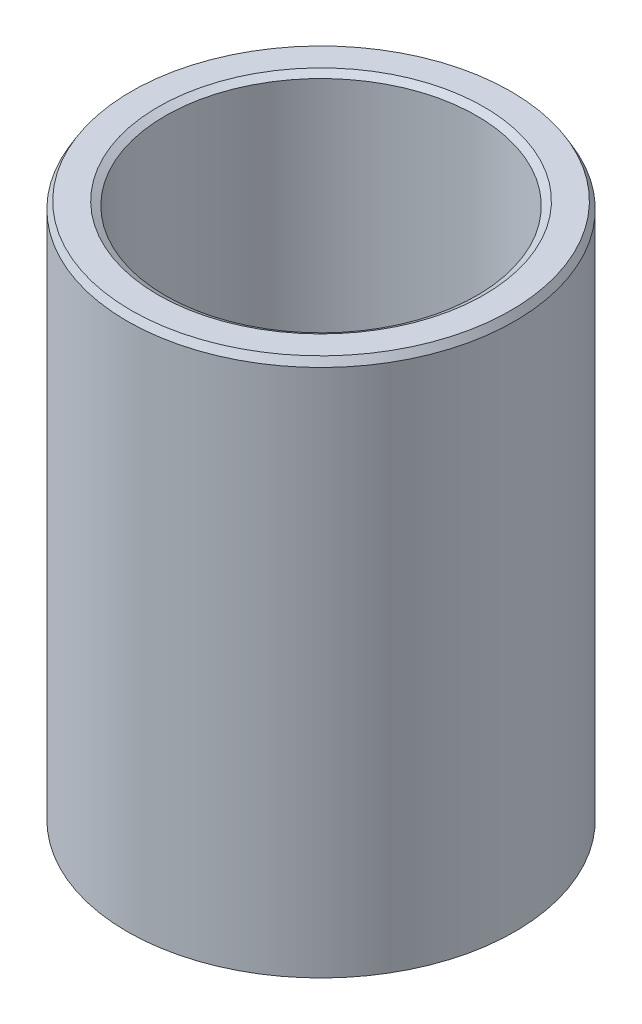
ISO-10303-21;
HEADER;
FILE_DESCRIPTION(('STEP AP214'),'2;1');
FILE_NAME('part.step','',(''),(''),'','','');
FILE_SCHEMA(('AUTOMOTIVE_DESIGN { 1 0 10303 214 1 1 1 1 }'));
ENDSEC;
DATA;
#1=APPLICATION_CONTEXT('core data for automotive mechanical design processes');
#2=APPLICATION_PROTOCOL_DEFINITION('international standard','automotive_design',2000,#1);
#3=PRODUCT_CONTEXT('',#1,'mechanical');
#4=PRODUCT('Part','Part','',(#3));
#5=PRODUCT_RELATED_PRODUCT_CATEGORY('part','',(#4));
#6=PRODUCT_DEFINITION_FORMATION('','',#4);
#7=PRODUCT_DEFINITION_CONTEXT('part definition',#1,'design');
#8=PRODUCT_DEFINITION('design','',#6,#7);
#9=PRODUCT_DEFINITION_SHAPE('','',#8);
#10=(LENGTH_UNIT() NAMED_UNIT(*) SI_UNIT(.MILLI.,.METRE.));
#11=(NAMED_UNIT(*) PLANE_ANGLE_UNIT() SI_UNIT($,.RADIAN.));
#12=(NAMED_UNIT(*) SI_UNIT($,.STERADIAN.) SOLID_ANGLE_UNIT());
#13=UNCERTAINTY_MEASURE_WITH_UNIT(LENGTH_MEASURE(1.E-05),#10,'distance_accuracy_value','');
#14=(GEOMETRIC_REPRESENTATION_CONTEXT(3) GLOBAL_UNCERTAINTY_ASSIGNED_CONTEXT((#13)) GLOBAL_UNIT_ASSIGNED_CONTEXT((#10,
#11,#12)) REPRESENTATION_CONTEXT('',''));
#15=CARTESIAN_POINT('',(0.,0.,0.));
#16=DIRECTION('',(0.,0.,1.));
#17=DIRECTION('',(1.,0.,0.));
#18=AXIS2_PLACEMENT_3D('',#15,#16,#17);
#19=CARTESIAN_POINT('',(0.,76.5854365545464,0.));
#20=DIRECTION('',(0.,-1.,0.));
#21=DIRECTION('',(0.,0.,-1.));
#22=AXIS2_PLACEMENT_3D('',#19,#20,#21);
#23=CYLINDRICAL_SURFACE('',#22,27.5);
#24=CARTESIAN_POINT('',(0.,0.586744164132319,0.));
#25=DIRECTION('',(0.,1.,0.));
#26=DIRECTION('',(0.,0.,1.));
#27=AXIS2_PLACEMENT_3D('',#24,#25,#26);
#28=CIRCLE('',#27,27.5);
#29=CARTESIAN_POINT('',(0.,0.586744164132319,27.5));
#30=VERTEX_POINT('',#29);
#31=EDGE_CURVE('E10',#30,#30,#28,.T.);
#32=ORIENTED_EDGE('',*,*,#31,.T.);
#33=EDGE_LOOP('',(#32));
#34=FACE_BOUND('',#33,.T.);
#35=CARTESIAN_POINT('',(0.,75.5691658512247,0.));
#36=DIRECTION('',(0.,1.,0.));
#37=DIRECTION('',(0.,0.,1.));
#38=AXIS2_PLACEMENT_3D('',#35,#36,#37);
#39=CIRCLE('',#38,27.5);
#40=CARTESIAN_POINT('',(0.,75.5691658512247,27.5));
#41=VERTEX_POINT('',#40);
#42=EDGE_CURVE('E50',#41,#41,#39,.F.);
#43=ORIENTED_EDGE('',*,*,#42,.T.);
#44=EDGE_LOOP('',(#43));
#45=FACE_BOUND('',#44,.T.);
#46=ADVANCED_FACE('F39',(#34,#45),#23,.T.);
#47=CARTESIAN_POINT('',(0.,76.5854365545464,0.));
#48=DIRECTION('',(0.,1.,0.));
#49=DIRECTION('',(0.,0.,1.));
#50=AXIS2_PLACEMENT_3D('',#47,#48,#49);
#51=PLANE('',#50);
#52=CARTESIAN_POINT('',(0.,76.5854365545464,0.));
#53=DIRECTION('',(0.,1.,0.));
#54=DIRECTION('',(0.,0.,1.));
#55=AXIS2_PLACEMENT_3D('',#52,#53,#54);
#56=CIRCLE('',#55,23.104034630655);
#57=CARTESIAN_POINT('',(0.,76.5854365545464,23.104034630655));
#58=VERTEX_POINT('',#57);
#59=EDGE_CURVE('E58',#58,#58,#56,.F.);
#60=ORIENTED_EDGE('',*,*,#59,.T.);
#61=EDGE_LOOP('',(#60));
#62=FACE_BOUND('',#61,.T.);
#63=CARTESIAN_POINT('',(0.,76.5854365545464,0.));
#64=DIRECTION('',(0.,1.,0.));
#65=DIRECTION('',(0.,0.,1.));
#66=AXIS2_PLACEMENT_3D('',#63,#64,#65);
#67=CIRCLE('',#66,26.9132558358677);
#68=CARTESIAN_POINT('',(0.,76.5854365545464,26.9132558358677));
#69=VERTEX_POINT('',#68);
#70=EDGE_CURVE('E61',#69,#69,#67,.T.);
#71=ORIENTED_EDGE('',*,*,#70,.T.);
#72=EDGE_LOOP('',(#71));
#73=FACE_BOUND('',#72,.T.);
#74=ADVANCED_FACE('F88',(#62,#73),#51,.T.);
#75=CARTESIAN_POINT('',(0.,0.,0.));
#76=DIRECTION('',(0.,1.,0.));
#77=DIRECTION('',(0.,0.,1.));
#78=AXIS2_PLACEMENT_3D('',#75,#76,#77);
#79=PLANE('',#78);
#80=CARTESIAN_POINT('',(0.,0.,0.));
#81=DIRECTION('',(0.,1.,0.));
#82=DIRECTION('',(0.,0.,1.));
#83=AXIS2_PLACEMENT_3D('',#80,#81,#82);
#84=CIRCLE('',#83,22.6745080914656);
#85=CARTESIAN_POINT('',(0.,0.,22.6745080914656));
#86=VERTEX_POINT('',#85);
#87=EDGE_CURVE('E51',#86,#86,#84,.T.);
#88=ORIENTED_EDGE('',*,*,#87,.T.);
#89=EDGE_LOOP('',(#88));
#90=FACE_BOUND('',#89,.T.);
#91=CARTESIAN_POINT('',(0.,0.,0.));
#92=DIRECTION('',(0.,1.,0.));
#93=DIRECTION('',(0.,0.,1.));
#94=AXIS2_PLACEMENT_3D('',#91,#92,#93);
#95=CIRCLE('',#94,26.4837292966783);
#96=CARTESIAN_POINT('',(0.,0.,26.4837292966783));
#97=VERTEX_POINT('',#96);
#98=EDGE_CURVE('E54',#97,#97,#95,.F.);
#99=ORIENTED_EDGE('',*,*,#98,.T.);
#100=EDGE_LOOP('',(#99));
#101=FACE_BOUND('',#100,.T.);
#102=ADVANCED_FACE('F83',(#90,#101),#79,.F.);
#103=CARTESIAN_POINT('',(0.,76.5854365545464,0.));
#104=DIRECTION('',(0.,-1.,0.));
#105=DIRECTION('',(0.,0.,-1.));
#106=AXIS2_PLACEMENT_3D('',#103,#104,#105);
#107=CYLINDRICAL_SURFACE('',#106,22.0877639273333);
#108=CARTESIAN_POINT('',(0.,75.9986923904141,0.));
#109=DIRECTION('',(0.,1.,0.));
#110=DIRECTION('',(0.,0.,1.));
#111=AXIS2_PLACEMENT_3D('',#108,#109,#110);
#112=CIRCLE('',#111,22.0877639273333);
#113=CARTESIAN_POINT('',(0.,75.9986923904141,22.0877639273333));
#114=VERTEX_POINT('',#113);
#115=EDGE_CURVE('E67',#114,#114,#112,.T.);
#116=ORIENTED_EDGE('',*,*,#115,.T.);
#117=EDGE_LOOP('',(#116));
#118=FACE_BOUND('',#117,.T.);
#119=CARTESIAN_POINT('',(0.,1.01627070332172,0.));
#120=DIRECTION('',(0.,1.,0.));
#121=DIRECTION('',(0.,0.,1.));
#122=AXIS2_PLACEMENT_3D('',#119,#120,#121);
#123=CIRCLE('',#122,22.0877639273333);
#124=CARTESIAN_POINT('',(0.,1.01627070332172,22.0877639273333));
#125=VERTEX_POINT('',#124);
#126=EDGE_CURVE('E69',#125,#125,#123,.F.);
#127=ORIENTED_EDGE('',*,*,#126,.T.);
#128=EDGE_LOOP('',(#127));
#129=FACE_BOUND('',#128,.T.);
#130=ADVANCED_FACE('F71',(#118,#129),#107,.F.);
#131=CARTESIAN_POINT('',(0.,75.9986923904141,0.));
#132=DIRECTION('',(0.,1.,0.));
#133=DIRECTION('',(0.,0.,1.));
#134=AXIS2_PLACEMENT_3D('',#131,#132,#133);
#135=CONICAL_SURFACE('',#134,22.0877639273333,1.0471975511966);
#136=ORIENTED_EDGE('',*,*,#59,.F.);
#137=EDGE_LOOP('',(#136));
#138=FACE_BOUND('',#137,.T.);
#139=ORIENTED_EDGE('',*,*,#115,.F.);
#140=EDGE_LOOP('',(#139));
#141=FACE_BOUND('',#140,.T.);
#142=ADVANCED_FACE('F77',(#138,#141),#135,.F.);
#143=CARTESIAN_POINT('',(0.,0.,0.));
#144=DIRECTION('',(0.,-1.,0.));
#145=DIRECTION('',(0.,0.,-1.));
#146=AXIS2_PLACEMENT_3D('',#143,#144,#145);
#147=CONICAL_SURFACE('',#146,22.6745080914656,0.523598775598294);
#148=ORIENTED_EDGE('',*,*,#126,.F.);
#149=EDGE_LOOP('',(#148));
#150=FACE_BOUND('',#149,.T.);
#151=ORIENTED_EDGE('',*,*,#87,.F.);
#152=EDGE_LOOP('',(#151));
#153=FACE_BOUND('',#152,.T.);
#154=ADVANCED_FACE('F73',(#150,#153),#147,.F.);
#155=CARTESIAN_POINT('',(0.,0.586744164132319,0.));
#156=DIRECTION('',(0.,1.,0.));
#157=DIRECTION('',(0.,0.,1.));
#158=AXIS2_PLACEMENT_3D('',#155,#156,#157);
#159=CONICAL_SURFACE('',#158,27.5,1.04719755119661);
#160=ORIENTED_EDGE('',*,*,#98,.F.);
#161=EDGE_LOOP('',(#160));
#162=FACE_BOUND('',#161,.T.);
#163=ORIENTED_EDGE('',*,*,#31,.F.);
#164=EDGE_LOOP('',(#163));
#165=FACE_BOUND('',#164,.T.);
#166=ADVANCED_FACE('F76',(#162,#165),#159,.T.);
#167=CARTESIAN_POINT('',(0.,76.5854365545464,0.));
#168=DIRECTION('',(0.,-1.,0.));
#169=DIRECTION('',(0.,0.,-1.));
#170=AXIS2_PLACEMENT_3D('',#167,#168,#169);
#171=CONICAL_SURFACE('',#170,26.9132558358677,0.523598775598289);
#172=ORIENTED_EDGE('',*,*,#42,.F.);
#173=EDGE_LOOP('',(#172));
#174=FACE_BOUND('',#173,.T.);
#175=ORIENTED_EDGE('',*,*,#70,.F.);
#176=EDGE_LOOP('',(#175));
#177=FACE_BOUND('',#176,.T.);
#178=ADVANCED_FACE('F45',(#174,#177),#171,.T.);
#179=CLOSED_SHELL('',(#46,#74,#102,#130,#142,#154,#166,#178));
#180=MANIFOLD_SOLID_BREP('B2',#179);
#181=ADVANCED_BREP_SHAPE_REPRESENTATION('',(#18,#180),#14);
#182=SHAPE_DEFINITION_REPRESENTATION(#9,#181);
ENDSEC;
END-ISO-10303-21;
